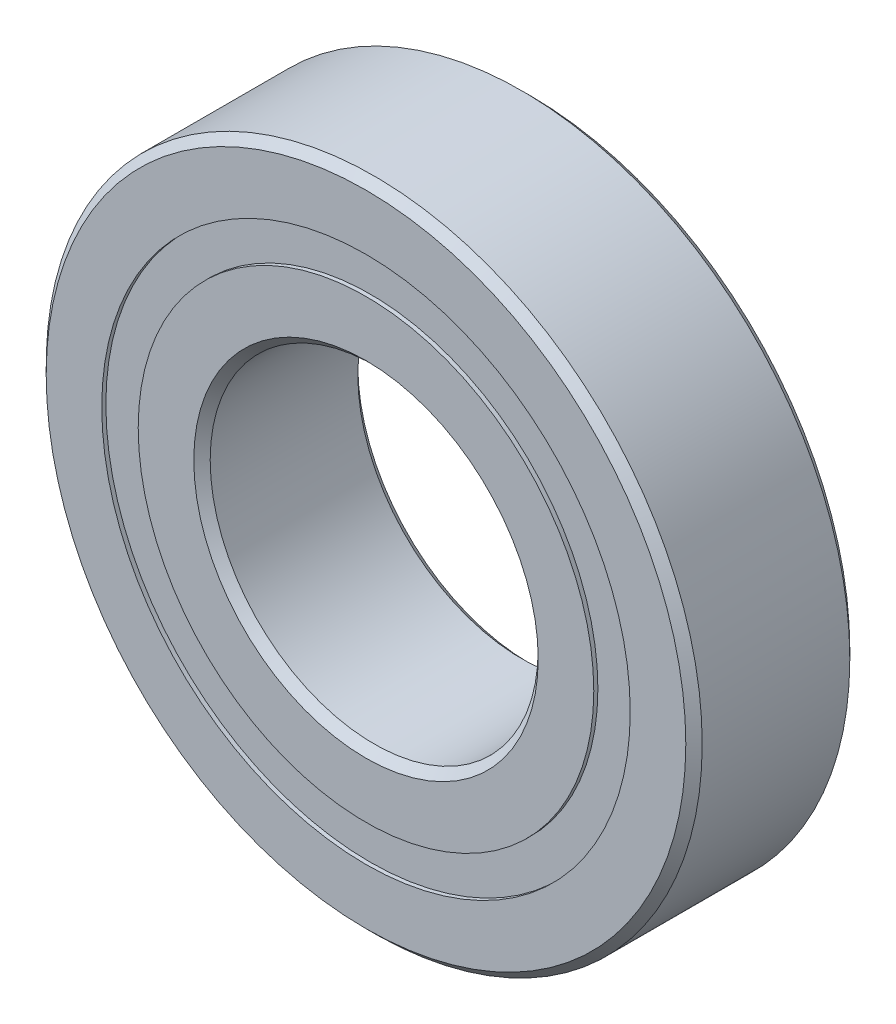
ISO-10303-21;
HEADER;
FILE_DESCRIPTION(('STEP AP214'),'2;1');
FILE_NAME('part.step','',(''),(''),'','','');
FILE_SCHEMA(('AUTOMOTIVE_DESIGN { 1 0 10303 214 1 1 1 1 }'));
ENDSEC;
DATA;
#1=APPLICATION_CONTEXT('core data for automotive mechanical design processes');
#2=APPLICATION_PROTOCOL_DEFINITION('international standard','automotive_design',2000,#1);
#3=PRODUCT_CONTEXT('',#1,'mechanical');
#4=PRODUCT('Part','Part','',(#3));
#5=PRODUCT_RELATED_PRODUCT_CATEGORY('part','',(#4));
#6=PRODUCT_DEFINITION_FORMATION('','',#4);
#7=PRODUCT_DEFINITION_CONTEXT('part definition',#1,'design');
#8=PRODUCT_DEFINITION('design','',#6,#7);
#9=PRODUCT_DEFINITION_SHAPE('','',#8);
#10=(LENGTH_UNIT() NAMED_UNIT(*) SI_UNIT(.MILLI.,.METRE.));
#11=(NAMED_UNIT(*) PLANE_ANGLE_UNIT() SI_UNIT($,.RADIAN.));
#12=(NAMED_UNIT(*) SI_UNIT($,.STERADIAN.) SOLID_ANGLE_UNIT());
#13=UNCERTAINTY_MEASURE_WITH_UNIT(LENGTH_MEASURE(1.E-05),#10,'distance_accuracy_value','');
#14=(GEOMETRIC_REPRESENTATION_CONTEXT(3) GLOBAL_UNCERTAINTY_ASSIGNED_CONTEXT((#13)) GLOBAL_UNIT_ASSIGNED_CONTEXT((#10,
#11,#12)) REPRESENTATION_CONTEXT('',''));
#15=CARTESIAN_POINT('',(0.,0.,0.));
#16=DIRECTION('',(0.,0.,1.));
#17=DIRECTION('',(1.,0.,0.));
#18=AXIS2_PLACEMENT_3D('',#15,#16,#17);
#19=CARTESIAN_POINT('',(0.,6.44444444444444,-0.993807989999909));
#20=DIRECTION('',(0.,0.,-1.));
#21=DIRECTION('',(-1.,0.,0.));
#22=AXIS2_PLACEMENT_3D('',#19,#20,#21);
#23=PLANE('',#22);
#24=CARTESIAN_POINT('',(0.,0.,-0.993807989999909));
#25=DIRECTION('',(0.,0.,1.));
#26=DIRECTION('',(1.,0.,0.));
#27=AXIS2_PLACEMENT_3D('',#24,#25,#26);
#28=CIRCLE('',#27,5.55555555555556);
#29=CARTESIAN_POINT('',(5.55555555555556,0.,-0.993807989999909));
#30=VERTEX_POINT('',#29);
#31=EDGE_CURVE('E11',#30,#30,#28,.T.);
#32=ORIENTED_EDGE('',*,*,#31,.F.);
#33=EDGE_LOOP('',(#32));
#34=FACE_BOUND('',#33,.T.);
#35=CARTESIAN_POINT('',(0.,0.,-0.993807989999909));
#36=DIRECTION('',(0.,0.,1.));
#37=DIRECTION('',(1.,0.,0.));
#38=AXIS2_PLACEMENT_3D('',#35,#36,#37);
#39=CIRCLE('',#38,6.44444444444444);
#40=CARTESIAN_POINT('',(6.44444444444444,0.,-0.993807989999909));
#41=VERTEX_POINT('',#40);
#42=EDGE_CURVE('E60',#41,#41,#39,.T.);
#43=ORIENTED_EDGE('',*,*,#42,.T.);
#44=EDGE_LOOP('',(#43));
#45=FACE_BOUND('',#44,.T.);
#46=ADVANCED_FACE('F46',(#34,#45),#23,.F.);
#47=CARTESIAN_POINT('',(0.,0.,2.));
#48=DIRECTION('',(0.,0.,1.));
#49=DIRECTION('',(1.,0.,0.));
#50=AXIS2_PLACEMENT_3D('',#47,#48,#49);
#51=CYLINDRICAL_SURFACE('',#50,5.55555555555556);
#52=CARTESIAN_POINT('',(0.,0.,-1.90000000000001));
#53=DIRECTION('',(0.,0.,1.));
#54=DIRECTION('',(1.,0.,0.));
#55=AXIS2_PLACEMENT_3D('',#52,#53,#54);
#56=CIRCLE('',#55,5.55555555555556);
#57=CARTESIAN_POINT('',(5.55555555555556,0.,-1.90000000000001));
#58=VERTEX_POINT('',#57);
#59=EDGE_CURVE('E52',#58,#58,#56,.T.);
#60=ORIENTED_EDGE('',*,*,#59,.F.);
#61=EDGE_LOOP('',(#60));
#62=FACE_BOUND('',#61,.T.);
#63=ORIENTED_EDGE('',*,*,#31,.T.);
#64=EDGE_LOOP('',(#63));
#65=FACE_BOUND('',#64,.T.);
#66=ADVANCED_FACE('F75',(#62,#65),#51,.F.);
#67=CARTESIAN_POINT('',(0.,6.44444444444444,-1.90000000000001));
#68=DIRECTION('',(0.,0.,1.));
#69=DIRECTION('',(1.,0.,0.));
#70=AXIS2_PLACEMENT_3D('',#67,#68,#69);
#71=PLANE('',#70);
#72=CARTESIAN_POINT('',(0.,0.,-1.90000000000001));
#73=DIRECTION('',(0.,0.,1.));
#74=DIRECTION('',(1.,0.,0.));
#75=AXIS2_PLACEMENT_3D('',#72,#73,#74);
#76=CIRCLE('',#75,6.44444444444444);
#77=CARTESIAN_POINT('',(6.44444444444444,0.,-1.90000000000001));
#78=VERTEX_POINT('',#77);
#79=EDGE_CURVE('E56',#78,#78,#76,.T.);
#80=ORIENTED_EDGE('',*,*,#79,.F.);
#81=EDGE_LOOP('',(#80));
#82=FACE_BOUND('',#81,.T.);
#83=ORIENTED_EDGE('',*,*,#59,.T.);
#84=EDGE_LOOP('',(#83));
#85=FACE_BOUND('',#84,.T.);
#86=ADVANCED_FACE('F70',(#82,#85),#71,.F.);
#87=CARTESIAN_POINT('',(0.,0.,2.));
#88=DIRECTION('',(0.,0.,1.));
#89=DIRECTION('',(1.,0.,0.));
#90=AXIS2_PLACEMENT_3D('',#87,#88,#89);
#91=CYLINDRICAL_SURFACE('',#90,6.44444444444444);
#92=ORIENTED_EDGE('',*,*,#42,.F.);
#93=EDGE_LOOP('',(#92));
#94=FACE_BOUND('',#93,.T.);
#95=ORIENTED_EDGE('',*,*,#79,.T.);
#96=EDGE_LOOP('',(#95));
#97=FACE_BOUND('',#96,.T.);
#98=ADVANCED_FACE('F67',(#94,#97),#91,.T.);
#99=CLOSED_SHELL('',(#46,#66,#86,#98));
#100=MANIFOLD_SOLID_BREP('B2',#99);
#101=CARTESIAN_POINT('',(0.,6.44444444444444,1.9));
#102=DIRECTION('',(0.,0.,-1.));
#103=DIRECTION('',(-1.,0.,0.));
#104=AXIS2_PLACEMENT_3D('',#101,#102,#103);
#105=PLANE('',#104);
#106=CARTESIAN_POINT('',(0.,0.,1.9));
#107=DIRECTION('',(0.,0.,1.));
#108=DIRECTION('',(1.,0.,0.));
#109=AXIS2_PLACEMENT_3D('',#106,#107,#108);
#110=CIRCLE('',#109,5.55555555555556);
#111=CARTESIAN_POINT('',(5.55555555555556,0.,1.9));
#112=VERTEX_POINT('',#111);
#113=EDGE_CURVE('E45',#112,#112,#110,.T.);
#114=ORIENTED_EDGE('',*,*,#113,.F.);
#115=EDGE_LOOP('',(#114));
#116=FACE_BOUND('',#115,.T.);
#117=CARTESIAN_POINT('',(0.,0.,1.9));
#118=DIRECTION('',(0.,0.,1.));
#119=DIRECTION('',(1.,0.,0.));
#120=AXIS2_PLACEMENT_3D('',#117,#118,#119);
#121=CIRCLE('',#120,6.44444444444444);
#122=CARTESIAN_POINT('',(6.44444444444444,0.,1.9));
#123=VERTEX_POINT('',#122);
#124=EDGE_CURVE('E128',#123,#123,#121,.T.);
#125=ORIENTED_EDGE('',*,*,#124,.T.);
#126=EDGE_LOOP('',(#125));
#127=FACE_BOUND('',#126,.T.);
#128=ADVANCED_FACE('F114',(#116,#127),#105,.F.);
#129=CARTESIAN_POINT('',(0.,0.,2.));
#130=DIRECTION('',(0.,0.,1.));
#131=DIRECTION('',(1.,0.,0.));
#132=AXIS2_PLACEMENT_3D('',#129,#130,#131);
#133=CYLINDRICAL_SURFACE('',#132,5.55555555555556);
#134=CARTESIAN_POINT('',(0.,0.,0.993807989999902));
#135=DIRECTION('',(0.,0.,1.));
#136=DIRECTION('',(1.,0.,0.));
#137=AXIS2_PLACEMENT_3D('',#134,#135,#136);
#138=CIRCLE('',#137,5.55555555555556);
#139=CARTESIAN_POINT('',(5.55555555555556,0.,0.993807989999902));
#140=VERTEX_POINT('',#139);
#141=EDGE_CURVE('E120',#140,#140,#138,.T.);
#142=ORIENTED_EDGE('',*,*,#141,.F.);
#143=EDGE_LOOP('',(#142));
#144=FACE_BOUND('',#143,.T.);
#145=ORIENTED_EDGE('',*,*,#113,.T.);
#146=EDGE_LOOP('',(#145));
#147=FACE_BOUND('',#146,.T.);
#148=ADVANCED_FACE('F143',(#144,#147),#133,.F.);
#149=CARTESIAN_POINT('',(0.,6.44444444444444,0.993807989999902));
#150=DIRECTION('',(0.,0.,1.));
#151=DIRECTION('',(1.,0.,0.));
#152=AXIS2_PLACEMENT_3D('',#149,#150,#151);
#153=PLANE('',#152);
#154=CARTESIAN_POINT('',(0.,0.,0.993807989999902));
#155=DIRECTION('',(0.,0.,1.));
#156=DIRECTION('',(1.,0.,0.));
#157=AXIS2_PLACEMENT_3D('',#154,#155,#156);
#158=CIRCLE('',#157,6.44444444444444);
#159=CARTESIAN_POINT('',(6.44444444444444,0.,0.993807989999902));
#160=VERTEX_POINT('',#159);
#161=EDGE_CURVE('E124',#160,#160,#158,.T.);
#162=ORIENTED_EDGE('',*,*,#161,.F.);
#163=EDGE_LOOP('',(#162));
#164=FACE_BOUND('',#163,.T.);
#165=ORIENTED_EDGE('',*,*,#141,.T.);
#166=EDGE_LOOP('',(#165));
#167=FACE_BOUND('',#166,.T.);
#168=ADVANCED_FACE('F138',(#164,#167),#153,.F.);
#169=CARTESIAN_POINT('',(0.,0.,2.));
#170=DIRECTION('',(0.,0.,1.));
#171=DIRECTION('',(1.,0.,0.));
#172=AXIS2_PLACEMENT_3D('',#169,#170,#171);
#173=CYLINDRICAL_SURFACE('',#172,6.44444444444444);
#174=ORIENTED_EDGE('',*,*,#124,.F.);
#175=EDGE_LOOP('',(#174));
#176=FACE_BOUND('',#175,.T.);
#177=ORIENTED_EDGE('',*,*,#161,.T.);
#178=EDGE_LOOP('',(#177));
#179=FACE_BOUND('',#178,.T.);
#180=ADVANCED_FACE('F135',(#176,#179),#173,.T.);
#181=CLOSED_SHELL('',(#128,#148,#168,#180));
#182=MANIFOLD_SOLID_BREP('B6',#181);
#183=CARTESIAN_POINT('',(-2.05212085995394,5.63815572471548,0.));
#184=DIRECTION('',(0.,0.,1.));
#185=DIRECTION('',(-0.342020143325657,0.939692620785913,0.));
#186=AXIS2_PLACEMENT_3D('',#183,#184,#185);
#187=SPHERICAL_SURFACE('',#186,0.993807989999902);
#188=CARTESIAN_POINT('',(-2.05212085995394,5.63815572471548,0.993807989999899));
#189=VERTEX_POINT('',#188);
#190=VERTEX_LOOP('',#189);
#191=FACE_BOUND('',#190,.T.);
#192=ADVANCED_FACE('F182',(#191),#187,.T.);
#193=CLOSED_SHELL('',(#192));
#194=MANIFOLD_SOLID_BREP('B40',#193);
#195=CARTESIAN_POINT('',(-3.85672565811918,4.59626665871392,0.));
#196=DIRECTION('',(0.,0.,1.));
#197=DIRECTION('',(-0.64278760968653,0.766044443118986,0.));
#198=AXIS2_PLACEMENT_3D('',#195,#196,#197);
#199=SPHERICAL_SURFACE('',#198,0.993807989999902);
#200=CARTESIAN_POINT('',(-3.85672565811918,4.59626665871392,0.993807989999899));
#201=VERTEX_POINT('',#200);
#202=VERTEX_LOOP('',#201);
#203=FACE_BOUND('',#202,.T.);
#204=ADVANCED_FACE('F201',(#203),#199,.T.);
#205=CLOSED_SHELL('',(#204));
#206=MANIFOLD_SOLID_BREP('B110',#205);
#207=CARTESIAN_POINT('',(-5.1961524227066,3.00000000000006,0.));
#208=DIRECTION('',(0.,0.,1.));
#209=DIRECTION('',(-0.866025403784433,0.50000000000001,0.));
#210=AXIS2_PLACEMENT_3D('',#207,#208,#209);
#211=SPHERICAL_SURFACE('',#210,0.993807989999902);
#212=CARTESIAN_POINT('',(-5.1961524227066,3.00000000000006,0.993807989999899));
#213=VERTEX_POINT('',#212);
#214=VERTEX_LOOP('',#213);
#215=FACE_BOUND('',#214,.T.);
#216=ADVANCED_FACE('F220',(#215),#211,.T.);
#217=CLOSED_SHELL('',(#216));
#218=MANIFOLD_SOLID_BREP('B178',#217);
#219=CARTESIAN_POINT('',(-5.90884651807324,1.04188906600164,0.));
#220=DIRECTION('',(0.,0.,1.));
#221=DIRECTION('',(-0.984807753012206,0.17364817766694,0.));
#222=AXIS2_PLACEMENT_3D('',#219,#220,#221);
#223=SPHERICAL_SURFACE('',#222,0.993807989999902);
#224=CARTESIAN_POINT('',(-5.90884651807324,1.04188906600164,0.993807989999899));
#225=VERTEX_POINT('',#224);
#226=VERTEX_LOOP('',#225);
#227=FACE_BOUND('',#226,.T.);
#228=ADVANCED_FACE('F254',(#227),#223,.T.);
#229=CLOSED_SHELL('',(#228));
#230=MANIFOLD_SOLID_BREP('B197',#229);
#231=CARTESIAN_POINT('',(-5.90884651807326,-1.04188906600152,0.));
#232=DIRECTION('',(0.,0.,1.));
#233=DIRECTION('',(-0.98480775301221,-0.173648177666921,0.));
#234=AXIS2_PLACEMENT_3D('',#231,#232,#233);
#235=SPHERICAL_SURFACE('',#234,0.993807989999902);
#236=CARTESIAN_POINT('',(-5.90884651807326,-1.04188906600152,0.993807989999899));
#237=VERTEX_POINT('',#236);
#238=VERTEX_LOOP('',#237);
#239=FACE_BOUND('',#238,.T.);
#240=ADVANCED_FACE('F288',(#239),#235,.T.);
#241=CLOSED_SHELL('',(#240));
#242=MANIFOLD_SOLID_BREP('B216',#241);
#243=CARTESIAN_POINT('',(-5.19615242270666,-2.99999999999995,0.));
#244=DIRECTION('',(0.,0.,1.));
#245=DIRECTION('',(-0.866025403784443,-0.499999999999992,0.));
#246=AXIS2_PLACEMENT_3D('',#243,#244,#245);
#247=SPHERICAL_SURFACE('',#246,0.993807989999902);
#248=CARTESIAN_POINT('',(-5.19615242270666,-2.99999999999995,0.993807989999899));
#249=VERTEX_POINT('',#248);
#250=VERTEX_LOOP('',#249);
#251=FACE_BOUND('',#250,.T.);
#252=ADVANCED_FACE('F322',(#251),#247,.T.);
#253=CLOSED_SHELL('',(#252));
#254=MANIFOLD_SOLID_BREP('B250',#253);
#255=CARTESIAN_POINT('',(-3.85672565811928,-4.59626665871384,0.));
#256=DIRECTION('',(0.,0.,1.));
#257=DIRECTION('',(-0.642787609686546,-0.766044443118973,0.));
#258=AXIS2_PLACEMENT_3D('',#255,#256,#257);
#259=SPHERICAL_SURFACE('',#258,0.993807989999902);
#260=CARTESIAN_POINT('',(-3.85672565811928,-4.59626665871384,0.993807989999899));
#261=VERTEX_POINT('',#260);
#262=VERTEX_LOOP('',#261);
#263=FACE_BOUND('',#262,.T.);
#264=ADVANCED_FACE('F356',(#263),#259,.T.);
#265=CLOSED_SHELL('',(#264));
#266=MANIFOLD_SOLID_BREP('B284',#265);
#267=CARTESIAN_POINT('',(-2.05212085995406,-5.63815572471544,0.));
#268=DIRECTION('',(0.,0.,1.));
#269=DIRECTION('',(-0.342020143325676,-0.939692620785906,0.));
#270=AXIS2_PLACEMENT_3D('',#267,#268,#269);
#271=SPHERICAL_SURFACE('',#270,0.993807989999902);
#272=CARTESIAN_POINT('',(-2.05212085995406,-5.63815572471544,0.993807989999899));
#273=VERTEX_POINT('',#272);
#274=VERTEX_LOOP('',#273);
#275=FACE_BOUND('',#274,.T.);
#276=ADVANCED_FACE('F390',(#275),#271,.T.);
#277=CLOSED_SHELL('',(#276));
#278=MANIFOLD_SOLID_BREP('B318',#277);
#279=CARTESIAN_POINT('',(0.,-6.,0.));
#280=DIRECTION('',(0.,0.,1.));
#281=DIRECTION('',(0.,-1.,0.));
#282=AXIS2_PLACEMENT_3D('',#279,#280,#281);
#283=SPHERICAL_SURFACE('',#282,0.993807989999902);
#284=CARTESIAN_POINT('',(0.,-6.,0.993807989999899));
#285=VERTEX_POINT('',#284);
#286=VERTEX_LOOP('',#285);
#287=FACE_BOUND('',#286,.T.);
#288=ADVANCED_FACE('F424',(#287),#283,.T.);
#289=CLOSED_SHELL('',(#288));
#290=MANIFOLD_SOLID_BREP('B352',#289);
#291=CARTESIAN_POINT('',(2.05212085995398,-5.63815572471547,0.));
#292=DIRECTION('',(0.,0.,1.));
#293=DIRECTION('',(0.342020143325663,-0.939692620785911,0.));
#294=AXIS2_PLACEMENT_3D('',#291,#292,#293);
#295=SPHERICAL_SURFACE('',#294,0.993807989999902);
#296=CARTESIAN_POINT('',(2.05212085995398,-5.63815572471547,0.993807989999899));
#297=VERTEX_POINT('',#296);
#298=VERTEX_LOOP('',#297);
#299=FACE_BOUND('',#298,.T.);
#300=ADVANCED_FACE('F458',(#299),#295,.T.);
#301=CLOSED_SHELL('',(#300));
#302=MANIFOLD_SOLID_BREP('B386',#301);
#303=CARTESIAN_POINT('',(3.85672565811921,-4.59626665871389,0.));
#304=DIRECTION('',(0.,0.,1.));
#305=DIRECTION('',(0.642787609686535,-0.766044443118981,0.));
#306=AXIS2_PLACEMENT_3D('',#303,#304,#305);
#307=SPHERICAL_SURFACE('',#306,0.993807989999902);
#308=CARTESIAN_POINT('',(3.85672565811921,-4.59626665871389,0.993807989999899));
#309=VERTEX_POINT('',#308);
#310=VERTEX_LOOP('',#309);
#311=FACE_BOUND('',#310,.T.);
#312=ADVANCED_FACE('F492',(#311),#307,.T.);
#313=CLOSED_SHELL('',(#312));
#314=MANIFOLD_SOLID_BREP('B420',#313);
#315=CARTESIAN_POINT('',(5.19615242270662,-3.00000000000003,0.));
#316=DIRECTION('',(0.,0.,1.));
#317=DIRECTION('',(0.866025403784436,-0.500000000000004,0.));
#318=AXIS2_PLACEMENT_3D('',#315,#316,#317);
#319=SPHERICAL_SURFACE('',#318,0.993807989999902);
#320=CARTESIAN_POINT('',(5.19615242270662,-3.00000000000003,0.993807989999899));
#321=VERTEX_POINT('',#320);
#322=VERTEX_LOOP('',#321);
#323=FACE_BOUND('',#322,.T.);
#324=ADVANCED_FACE('F526',(#323),#319,.T.);
#325=CLOSED_SHELL('',(#324));
#326=MANIFOLD_SOLID_BREP('B454',#325);
#327=CARTESIAN_POINT('',(5.90884651807325,-1.0418890660016,0.));
#328=DIRECTION('',(0.,0.,1.));
#329=DIRECTION('',(0.984807753012207,-0.173648177666934,0.));
#330=AXIS2_PLACEMENT_3D('',#327,#328,#329);
#331=SPHERICAL_SURFACE('',#330,0.993807989999902);
#332=CARTESIAN_POINT('',(5.90884651807325,-1.0418890660016,0.993807989999899));
#333=VERTEX_POINT('',#332);
#334=VERTEX_LOOP('',#333);
#335=FACE_BOUND('',#334,.T.);
#336=ADVANCED_FACE('F560',(#335),#331,.T.);
#337=CLOSED_SHELL('',(#336));
#338=MANIFOLD_SOLID_BREP('B488',#337);
#339=CARTESIAN_POINT('',(5.90884651807325,1.04188906600156,0.));
#340=DIRECTION('',(0.,0.,1.));
#341=DIRECTION('',(0.984807753012209,0.173648177666927,0.));
#342=AXIS2_PLACEMENT_3D('',#339,#340,#341);
#343=SPHERICAL_SURFACE('',#342,0.993807989999902);
#344=CARTESIAN_POINT('',(5.90884651807325,1.04188906600156,0.993807989999899));
#345=VERTEX_POINT('',#344);
#346=VERTEX_LOOP('',#345);
#347=FACE_BOUND('',#346,.T.);
#348=ADVANCED_FACE('F594',(#347),#343,.T.);
#349=CLOSED_SHELL('',(#348));
#350=MANIFOLD_SOLID_BREP('B522',#349);
#351=CARTESIAN_POINT('',(5.19615242270664,2.99999999999999,0.));
#352=DIRECTION('',(0.,0.,1.));
#353=DIRECTION('',(0.86602540378444,0.499999999999998,0.));
#354=AXIS2_PLACEMENT_3D('',#351,#352,#353);
#355=SPHERICAL_SURFACE('',#354,0.993807989999902);
#356=CARTESIAN_POINT('',(5.19615242270664,2.99999999999999,0.993807989999899));
#357=VERTEX_POINT('',#356);
#358=VERTEX_LOOP('',#357);
#359=FACE_BOUND('',#358,.T.);
#360=ADVANCED_FACE('F628',(#359),#355,.T.);
#361=CLOSED_SHELL('',(#360));
#362=MANIFOLD_SOLID_BREP('B556',#361);
#363=CARTESIAN_POINT('',(3.85672565811924,4.59626665871386,0.));
#364=DIRECTION('',(0.,0.,1.));
#365=DIRECTION('',(0.642787609686541,0.766044443118977,0.));
#366=AXIS2_PLACEMENT_3D('',#363,#364,#365);
#367=SPHERICAL_SURFACE('',#366,0.993807989999902);
#368=CARTESIAN_POINT('',(3.85672565811924,4.59626665871386,0.993807989999899));
#369=VERTEX_POINT('',#368);
#370=VERTEX_LOOP('',#369);
#371=FACE_BOUND('',#370,.T.);
#372=ADVANCED_FACE('F662',(#371),#367,.T.);
#373=CLOSED_SHELL('',(#372));
#374=MANIFOLD_SOLID_BREP('B590',#373);
#375=CARTESIAN_POINT('',(2.05212085995402,5.63815572471545,0.));
#376=DIRECTION('',(0.,0.,1.));
#377=DIRECTION('',(0.342020143325669,0.939692620785908,0.));
#378=AXIS2_PLACEMENT_3D('',#375,#376,#377);
#379=SPHERICAL_SURFACE('',#378,0.993807989999902);
#380=CARTESIAN_POINT('',(2.05212085995402,5.63815572471545,0.993807989999899));
#381=VERTEX_POINT('',#380);
#382=VERTEX_LOOP('',#381);
#383=FACE_BOUND('',#382,.T.);
#384=ADVANCED_FACE('F696',(#383),#379,.T.);
#385=CLOSED_SHELL('',(#384));
#386=MANIFOLD_SOLID_BREP('B624',#385);
#387=CARTESIAN_POINT('',(0.,6.,0.));
#388=DIRECTION('',(0.,0.,1.));
#389=DIRECTION('',(0.,1.,0.));
#390=AXIS2_PLACEMENT_3D('',#387,#388,#389);
#391=SPHERICAL_SURFACE('',#390,0.993807989999902);
#392=CARTESIAN_POINT('',(0.,6.,0.993807989999899));
#393=VERTEX_POINT('',#392);
#394=VERTEX_LOOP('',#393);
#395=FACE_BOUND('',#394,.T.);
#396=ADVANCED_FACE('F732',(#395),#391,.T.);
#397=CLOSED_SHELL('',(#396));
#398=MANIFOLD_SOLID_BREP('B658',#397);
#399=CARTESIAN_POINT('',(0.,5.55555555555556,2.));
#400=DIRECTION('',(0.,0.,-1.));
#401=DIRECTION('',(-1.,0.,0.));
#402=AXIS2_PLACEMENT_3D('',#399,#400,#401);
#403=PLANE('',#402);
#404=CARTESIAN_POINT('',(0.,0.,2.));
#405=DIRECTION('',(0.,0.,1.));
#406=DIRECTION('',(1.,0.,0.));
#407=AXIS2_PLACEMENT_3D('',#404,#405,#406);
#408=CIRCLE('',#407,4.2);
#409=CARTESIAN_POINT('',(4.2,0.,2.));
#410=VERTEX_POINT('',#409);
#411=EDGE_CURVE('E731',#410,#410,#408,.T.);
#412=ORIENTED_EDGE('',*,*,#411,.F.);
#413=EDGE_LOOP('',(#412));
#414=FACE_BOUND('',#413,.T.);
#415=CARTESIAN_POINT('',(0.,0.,2.));
#416=DIRECTION('',(0.,0.,1.));
#417=DIRECTION('',(1.,0.,0.));
#418=AXIS2_PLACEMENT_3D('',#415,#416,#417);
#419=CIRCLE('',#418,5.55555555555556);
#420=CARTESIAN_POINT('',(5.55555555555556,0.,2.));
#421=VERTEX_POINT('',#420);
#422=EDGE_CURVE('E780',#421,#421,#419,.T.);
#423=ORIENTED_EDGE('',*,*,#422,.T.);
#424=EDGE_LOOP('',(#423));
#425=FACE_BOUND('',#424,.T.);
#426=ADVANCED_FACE('F752',(#414,#425),#403,.F.);
#427=CARTESIAN_POINT('',(0.,0.,2.));
#428=DIRECTION('',(0.,0.,1.));
#429=DIRECTION('',(1.,0.,0.));
#430=AXIS2_PLACEMENT_3D('',#427,#428,#429);
#431=CONICAL_SURFACE('',#430,4.2,0.785398163397444);
#432=CARTESIAN_POINT('',(0.,0.,1.8));
#433=DIRECTION('',(0.,0.,1.));
#434=DIRECTION('',(1.,0.,0.));
#435=AXIS2_PLACEMENT_3D('',#432,#433,#434);
#436=CIRCLE('',#435,4.);
#437=CARTESIAN_POINT('',(4.,0.,1.8));
#438=VERTEX_POINT('',#437);
#439=EDGE_CURVE('E758',#438,#438,#436,.T.);
#440=ORIENTED_EDGE('',*,*,#439,.F.);
#441=EDGE_LOOP('',(#440));
#442=FACE_BOUND('',#441,.T.);
#443=ORIENTED_EDGE('',*,*,#411,.T.);
#444=EDGE_LOOP('',(#443));
#445=FACE_BOUND('',#444,.T.);
#446=ADVANCED_FACE('F817',(#442,#445),#431,.F.);
#447=CARTESIAN_POINT('',(0.,0.,2.));
#448=DIRECTION('',(0.,0.,1.));
#449=DIRECTION('',(1.,0.,0.));
#450=AXIS2_PLACEMENT_3D('',#447,#448,#449);
#451=CYLINDRICAL_SURFACE('',#450,4.);
#452=CARTESIAN_POINT('',(0.,0.,-1.8));
#453=DIRECTION('',(0.,0.,1.));
#454=DIRECTION('',(1.,0.,0.));
#455=AXIS2_PLACEMENT_3D('',#452,#453,#454);
#456=CIRCLE('',#455,4.);
#457=CARTESIAN_POINT('',(4.,0.,-1.8));
#458=VERTEX_POINT('',#457);
#459=EDGE_CURVE('E762',#458,#458,#456,.T.);
#460=ORIENTED_EDGE('',*,*,#459,.F.);
#461=EDGE_LOOP('',(#460));
#462=FACE_BOUND('',#461,.T.);
#463=ORIENTED_EDGE('',*,*,#439,.T.);
#464=EDGE_LOOP('',(#463));
#465=FACE_BOUND('',#464,.T.);
#466=ADVANCED_FACE('F812',(#462,#465),#451,.F.);
#467=CARTESIAN_POINT('',(0.,0.,-1.8));
#468=DIRECTION('',(0.,0.,-1.));
#469=DIRECTION('',(-1.,0.,0.));
#470=AXIS2_PLACEMENT_3D('',#467,#468,#469);
#471=CONICAL_SURFACE('',#470,4.,0.785398163397444);
#472=CARTESIAN_POINT('',(0.,0.,-2.));
#473=DIRECTION('',(0.,0.,1.));
#474=DIRECTION('',(1.,0.,0.));
#475=AXIS2_PLACEMENT_3D('',#472,#473,#474);
#476=CIRCLE('',#475,4.2);
#477=CARTESIAN_POINT('',(4.2,0.,-2.));
#478=VERTEX_POINT('',#477);
#479=EDGE_CURVE('E766',#478,#478,#476,.T.);
#480=ORIENTED_EDGE('',*,*,#479,.F.);
#481=EDGE_LOOP('',(#480));
#482=FACE_BOUND('',#481,.T.);
#483=ORIENTED_EDGE('',*,*,#459,.T.);
#484=EDGE_LOOP('',(#483));
#485=FACE_BOUND('',#484,.T.);
#486=ADVANCED_FACE('F806',(#482,#485),#471,.F.);
#487=CARTESIAN_POINT('',(0.,5.55555555555556,-2.));
#488=DIRECTION('',(0.,0.,1.));
#489=DIRECTION('',(1.,0.,0.));
#490=AXIS2_PLACEMENT_3D('',#487,#488,#489);
#491=PLANE('',#490);
#492=CARTESIAN_POINT('',(0.,0.,-2.));
#493=DIRECTION('',(0.,0.,1.));
#494=DIRECTION('',(1.,0.,0.));
#495=AXIS2_PLACEMENT_3D('',#492,#493,#494);
#496=CIRCLE('',#495,5.55555555555556);
#497=CARTESIAN_POINT('',(5.55555555555556,0.,-2.));
#498=VERTEX_POINT('',#497);
#499=EDGE_CURVE('E771',#498,#498,#496,.T.);
#500=ORIENTED_EDGE('',*,*,#499,.F.);
#501=EDGE_LOOP('',(#500));
#502=FACE_BOUND('',#501,.T.);
#503=ORIENTED_EDGE('',*,*,#479,.T.);
#504=EDGE_LOOP('',(#503));
#505=FACE_BOUND('',#504,.T.);
#506=ADVANCED_FACE('F800',(#502,#505),#491,.F.);
#507=CARTESIAN_POINT('',(0.,0.,2.));
#508=DIRECTION('',(0.,0.,1.));
#509=DIRECTION('',(1.,0.,0.));
#510=AXIS2_PLACEMENT_3D('',#507,#508,#509);
#511=CYLINDRICAL_SURFACE('',#510,5.55555555555556);
#512=CARTESIAN_POINT('',(0.,0.,-0.88888888888889));
#513=DIRECTION('',(0.,0.,1.));
#514=DIRECTION('',(1.,0.,0.));
#515=AXIS2_PLACEMENT_3D('',#512,#513,#514);
#516=CIRCLE('',#515,5.55555555555556);
#517=CARTESIAN_POINT('',(5.55555555555556,0.,-0.88888888888889));
#518=VERTEX_POINT('',#517);
#519=EDGE_CURVE('E774',#518,#518,#516,.T.);
#520=ORIENTED_EDGE('',*,*,#519,.F.);
#521=EDGE_LOOP('',(#520));
#522=FACE_BOUND('',#521,.T.);
#523=ORIENTED_EDGE('',*,*,#499,.T.);
#524=EDGE_LOOP('',(#523));
#525=FACE_BOUND('',#524,.T.);
#526=ADVANCED_FACE('F794',(#522,#525),#511,.T.);
#527=CARTESIAN_POINT('',(0.,0.,0.));
#528=DIRECTION('',(0.,0.,1.));
#529=DIRECTION('',(1.,0.,0.));
#530=AXIS2_PLACEMENT_3D('',#527,#528,#529);
#531=TOROIDAL_SURFACE('',#530,6.,0.993807989999903);
#532=CARTESIAN_POINT('',(0.,0.,0.888888888888885));
#533=DIRECTION('',(0.,0.,1.));
#534=DIRECTION('',(1.,0.,0.));
#535=AXIS2_PLACEMENT_3D('',#532,#533,#534);
#536=CIRCLE('',#535,5.55555555555556);
#537=CARTESIAN_POINT('',(5.55555555555556,0.,0.888888888888885));
#538=VERTEX_POINT('',#537);
#539=EDGE_CURVE('E777',#538,#538,#536,.T.);
#540=ORIENTED_EDGE('',*,*,#539,.F.);
#541=EDGE_LOOP('',(#540));
#542=FACE_BOUND('',#541,.T.);
#543=ORIENTED_EDGE('',*,*,#519,.T.);
#544=EDGE_LOOP('',(#543));
#545=FACE_BOUND('',#544,.T.);
#546=ADVANCED_FACE('F788',(#542,#545),#531,.F.);
#547=CARTESIAN_POINT('',(0.,0.,2.));
#548=DIRECTION('',(0.,0.,1.));
#549=DIRECTION('',(1.,0.,0.));
#550=AXIS2_PLACEMENT_3D('',#547,#548,#549);
#551=CYLINDRICAL_SURFACE('',#550,5.55555555555556);
#552=ORIENTED_EDGE('',*,*,#422,.F.);
#553=EDGE_LOOP('',(#552));
#554=FACE_BOUND('',#553,.T.);
#555=ORIENTED_EDGE('',*,*,#539,.T.);
#556=EDGE_LOOP('',(#555));
#557=FACE_BOUND('',#556,.T.);
#558=ADVANCED_FACE('F785',(#554,#557),#551,.T.);
#559=CLOSED_SHELL('',(#426,#446,#466,#486,#506,#526,#546,#558));
#560=MANIFOLD_SOLID_BREP('B692',#559);
#561=CARTESIAN_POINT('',(0.,0.,1.8));
#562=DIRECTION('',(0.,0.,-1.));
#563=DIRECTION('',(-1.,0.,0.));
#564=AXIS2_PLACEMENT_3D('',#561,#562,#563);
#565=CONICAL_SURFACE('',#564,8.,0.785398163397446);
#566=CARTESIAN_POINT('',(0.,0.,2.));
#567=DIRECTION('',(0.,0.,1.));
#568=DIRECTION('',(1.,0.,0.));
#569=AXIS2_PLACEMENT_3D('',#566,#567,#568);
#570=CIRCLE('',#569,7.8);
#571=CARTESIAN_POINT('',(7.8,0.,2.));
#572=VERTEX_POINT('',#571);
#573=EDGE_CURVE('E902',#572,#572,#570,.T.);
#574=ORIENTED_EDGE('',*,*,#573,.F.);
#575=EDGE_LOOP('',(#574));
#576=FACE_BOUND('',#575,.T.);
#577=CARTESIAN_POINT('',(0.,0.,1.8));
#578=DIRECTION('',(0.,0.,1.));
#579=DIRECTION('',(1.,0.,0.));
#580=AXIS2_PLACEMENT_3D('',#577,#578,#579);
#581=CIRCLE('',#580,8.);
#582=CARTESIAN_POINT('',(8.,0.,1.8));
#583=VERTEX_POINT('',#582);
#584=EDGE_CURVE('E751',#583,#583,#581,.T.);
#585=ORIENTED_EDGE('',*,*,#584,.T.);
#586=EDGE_LOOP('',(#585));
#587=FACE_BOUND('',#586,.T.);
#588=ADVANCED_FACE('F874',(#576,#587),#565,.T.);
#589=CARTESIAN_POINT('',(0.,0.,2.));
#590=DIRECTION('',(0.,0.,1.));
#591=DIRECTION('',(1.,0.,0.));
#592=AXIS2_PLACEMENT_3D('',#589,#590,#591);
#593=CYLINDRICAL_SURFACE('',#592,8.);
#594=ORIENTED_EDGE('',*,*,#584,.F.);
#595=EDGE_LOOP('',(#594));
#596=FACE_BOUND('',#595,.T.);
#597=CARTESIAN_POINT('',(0.,0.,-1.80000000000001));
#598=DIRECTION('',(0.,0.,1.));
#599=DIRECTION('',(1.,0.,0.));
#600=AXIS2_PLACEMENT_3D('',#597,#598,#599);
#601=CIRCLE('',#600,8.);
#602=CARTESIAN_POINT('',(8.,0.,-1.80000000000001));
#603=VERTEX_POINT('',#602);
#604=EDGE_CURVE('E880',#603,#603,#601,.T.);
#605=ORIENTED_EDGE('',*,*,#604,.T.);
#606=EDGE_LOOP('',(#605));
#607=FACE_BOUND('',#606,.T.);
#608=ADVANCED_FACE('F909',(#596,#607),#593,.T.);
#609=CARTESIAN_POINT('',(0.,0.,-2.00000000000001));
#610=DIRECTION('',(0.,0.,1.));
#611=DIRECTION('',(1.,0.,0.));
#612=AXIS2_PLACEMENT_3D('',#609,#610,#611);
#613=CONICAL_SURFACE('',#612,7.8,0.785398163397446);
#614=ORIENTED_EDGE('',*,*,#604,.F.);
#615=EDGE_LOOP('',(#614));
#616=FACE_BOUND('',#615,.T.);
#617=CARTESIAN_POINT('',(0.,0.,-2.00000000000001));
#618=DIRECTION('',(0.,0.,1.));
#619=DIRECTION('',(1.,0.,0.));
#620=AXIS2_PLACEMENT_3D('',#617,#618,#619);
#621=CIRCLE('',#620,7.8);
#622=CARTESIAN_POINT('',(7.8,0.,-2.00000000000001));
#623=VERTEX_POINT('',#622);
#624=EDGE_CURVE('E884',#623,#623,#621,.T.);
#625=ORIENTED_EDGE('',*,*,#624,.T.);
#626=EDGE_LOOP('',(#625));
#627=FACE_BOUND('',#626,.T.);
#628=ADVANCED_FACE('F913',(#616,#627),#613,.T.);
#629=CARTESIAN_POINT('',(0.,7.8,-2.00000000000001));
#630=DIRECTION('',(0.,0.,1.));
#631=DIRECTION('',(1.,0.,0.));
#632=AXIS2_PLACEMENT_3D('',#629,#630,#631);
#633=PLANE('',#632);
#634=ORIENTED_EDGE('',*,*,#624,.F.);
#635=EDGE_LOOP('',(#634));
#636=FACE_BOUND('',#635,.T.);
#637=CARTESIAN_POINT('',(0.,0.,-2.00000000000001));
#638=DIRECTION('',(0.,0.,1.));
#639=DIRECTION('',(1.,0.,0.));
#640=AXIS2_PLACEMENT_3D('',#637,#638,#639);
#641=CIRCLE('',#640,6.44444444444444);
#642=CARTESIAN_POINT('',(6.44444444444444,0.,-2.00000000000001));
#643=VERTEX_POINT('',#642);
#644=EDGE_CURVE('E888',#643,#643,#641,.T.);
#645=ORIENTED_EDGE('',*,*,#644,.T.);
#646=EDGE_LOOP('',(#645));
#647=FACE_BOUND('',#646,.T.);
#648=ADVANCED_FACE('F918',(#636,#647),#633,.F.);
#649=CARTESIAN_POINT('',(0.,0.,2.));
#650=DIRECTION('',(0.,0.,1.));
#651=DIRECTION('',(1.,0.,0.));
#652=AXIS2_PLACEMENT_3D('',#649,#650,#651);
#653=CYLINDRICAL_SURFACE('',#652,6.44444444444444);
#654=ORIENTED_EDGE('',*,*,#644,.F.);
#655=EDGE_LOOP('',(#654));
#656=FACE_BOUND('',#655,.T.);
#657=CARTESIAN_POINT('',(0.,0.,-0.888888888888893));
#658=DIRECTION('',(0.,0.,1.));
#659=DIRECTION('',(1.,0.,0.));
#660=AXIS2_PLACEMENT_3D('',#657,#658,#659);
#661=CIRCLE('',#660,6.44444444444444);
#662=CARTESIAN_POINT('',(6.44444444444444,0.,-0.888888888888893));
#663=VERTEX_POINT('',#662);
#664=EDGE_CURVE('E893',#663,#663,#661,.T.);
#665=ORIENTED_EDGE('',*,*,#664,.T.);
#666=EDGE_LOOP('',(#665));
#667=FACE_BOUND('',#666,.T.);
#668=ADVANCED_FACE('F924',(#656,#667),#653,.F.);
#669=CARTESIAN_POINT('',(0.,0.,0.));
#670=DIRECTION('',(0.,0.,1.));
#671=DIRECTION('',(1.,0.,0.));
#672=AXIS2_PLACEMENT_3D('',#669,#670,#671);
#673=TOROIDAL_SURFACE('',#672,6.,0.993807989999905);
#674=ORIENTED_EDGE('',*,*,#664,.F.);
#675=EDGE_LOOP('',(#674));
#676=FACE_BOUND('',#675,.T.);
#677=CARTESIAN_POINT('',(0.,0.,0.888888888888885));
#678=DIRECTION('',(0.,0.,1.));
#679=DIRECTION('',(1.,0.,0.));
#680=AXIS2_PLACEMENT_3D('',#677,#678,#679);
#681=CIRCLE('',#680,6.44444444444444);
#682=CARTESIAN_POINT('',(6.44444444444444,0.,0.888888888888885));
#683=VERTEX_POINT('',#682);
#684=EDGE_CURVE('E896',#683,#683,#681,.T.);
#685=ORIENTED_EDGE('',*,*,#684,.T.);
#686=EDGE_LOOP('',(#685));
#687=FACE_BOUND('',#686,.T.);
#688=ADVANCED_FACE('F928',(#676,#687),#673,.F.);
#689=CARTESIAN_POINT('',(0.,0.,2.));
#690=DIRECTION('',(0.,0.,1.));
#691=DIRECTION('',(1.,0.,0.));
#692=AXIS2_PLACEMENT_3D('',#689,#690,#691);
#693=CYLINDRICAL_SURFACE('',#692,6.44444444444444);
#694=ORIENTED_EDGE('',*,*,#684,.F.);
#695=EDGE_LOOP('',(#694));
#696=FACE_BOUND('',#695,.T.);
#697=CARTESIAN_POINT('',(0.,0.,2.));
#698=DIRECTION('',(0.,0.,1.));
#699=DIRECTION('',(1.,0.,0.));
#700=AXIS2_PLACEMENT_3D('',#697,#698,#699);
#701=CIRCLE('',#700,6.44444444444444);
#702=CARTESIAN_POINT('',(6.44444444444444,0.,2.));
#703=VERTEX_POINT('',#702);
#704=EDGE_CURVE('E899',#703,#703,#701,.T.);
#705=ORIENTED_EDGE('',*,*,#704,.T.);
#706=EDGE_LOOP('',(#705));
#707=FACE_BOUND('',#706,.T.);
#708=ADVANCED_FACE('F932',(#696,#707),#693,.F.);
#709=CARTESIAN_POINT('',(0.,7.8,2.));
#710=DIRECTION('',(0.,0.,-1.));
#711=DIRECTION('',(-1.,0.,0.));
#712=AXIS2_PLACEMENT_3D('',#709,#710,#711);
#713=PLANE('',#712);
#714=ORIENTED_EDGE('',*,*,#704,.F.);
#715=EDGE_LOOP('',(#714));
#716=FACE_BOUND('',#715,.T.);
#717=ORIENTED_EDGE('',*,*,#573,.T.);
#718=EDGE_LOOP('',(#717));
#719=FACE_BOUND('',#718,.T.);
#720=ADVANCED_FACE('F906',(#716,#719),#713,.F.);
#721=CLOSED_SHELL('',(#588,#608,#628,#648,#668,#688,#708,#720));
#722=MANIFOLD_SOLID_BREP('B726',#721);
#723=ADVANCED_BREP_SHAPE_REPRESENTATION('',(#18,#100,#182,#194,#206,#218,#230,#242,#254,#266,
#278,#290,#302,#314,#326,#338,#350,#362,#374,#386,#398,#560,#722),#14);
#724=SHAPE_DEFINITION_REPRESENTATION(#9,#723);
ENDSEC;
END-ISO-10303-21;
